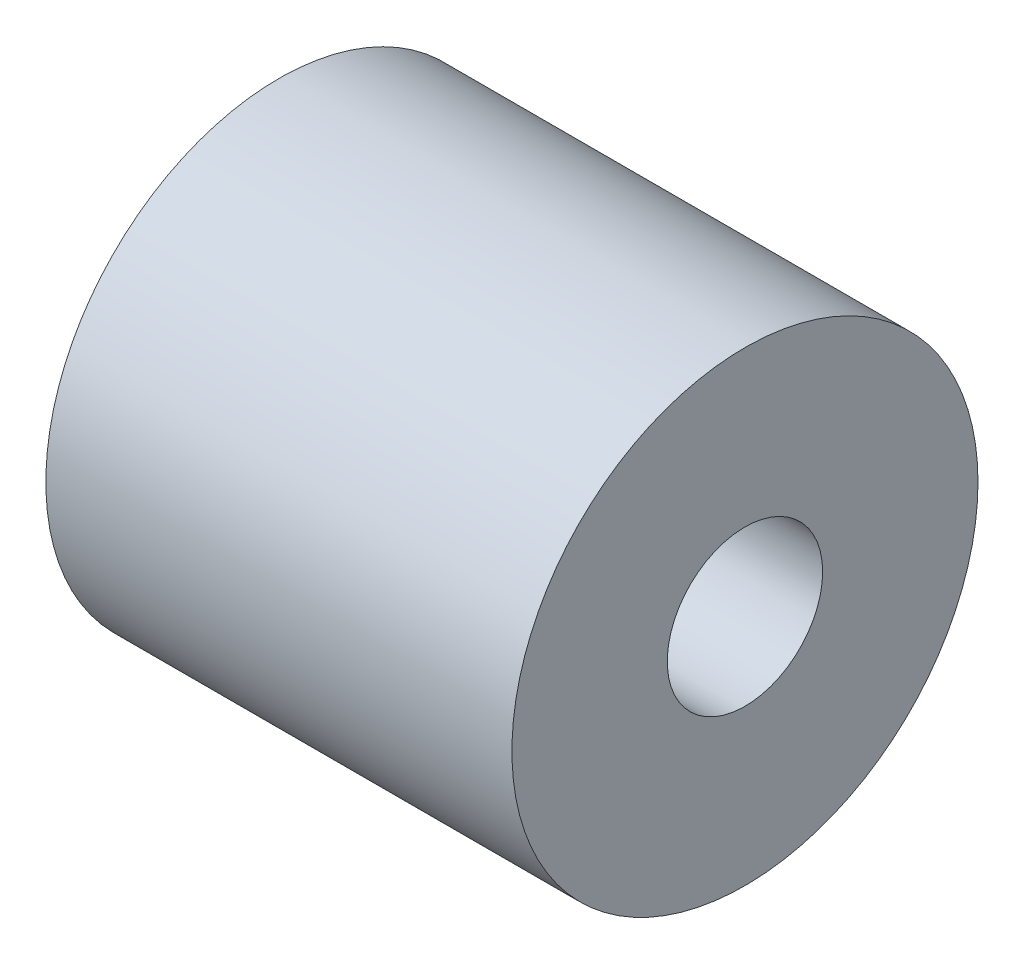
ISO-10303-21;
HEADER;
FILE_DESCRIPTION(('STEP AP214'),'2;1');
FILE_NAME('part.step','',(''),(''),'','','');
FILE_SCHEMA(('AUTOMOTIVE_DESIGN { 1 0 10303 214 1 1 1 1 }'));
ENDSEC;
DATA;
#1=APPLICATION_CONTEXT('core data for automotive mechanical design processes');
#2=APPLICATION_PROTOCOL_DEFINITION('international standard','automotive_design',2000,#1);
#3=PRODUCT_CONTEXT('',#1,'mechanical');
#4=PRODUCT('Part','Part','',(#3));
#5=PRODUCT_RELATED_PRODUCT_CATEGORY('part','',(#4));
#6=PRODUCT_DEFINITION_FORMATION('','',#4);
#7=PRODUCT_DEFINITION_CONTEXT('part definition',#1,'design');
#8=PRODUCT_DEFINITION('design','',#6,#7);
#9=PRODUCT_DEFINITION_SHAPE('','',#8);
#10=(LENGTH_UNIT() NAMED_UNIT(*) SI_UNIT(.MILLI.,.METRE.));
#11=(NAMED_UNIT(*) PLANE_ANGLE_UNIT() SI_UNIT($,.RADIAN.));
#12=(NAMED_UNIT(*) SI_UNIT($,.STERADIAN.) SOLID_ANGLE_UNIT());
#13=UNCERTAINTY_MEASURE_WITH_UNIT(LENGTH_MEASURE(1.E-05),#10,'distance_accuracy_value','');
#14=(GEOMETRIC_REPRESENTATION_CONTEXT(3) GLOBAL_UNCERTAINTY_ASSIGNED_CONTEXT((#13)) GLOBAL_UNIT_ASSIGNED_CONTEXT((#10,
#11,#12)) REPRESENTATION_CONTEXT('',''));
#15=CARTESIAN_POINT('',(0.,0.,0.));
#16=DIRECTION('',(0.,0.,1.));
#17=DIRECTION('',(1.,0.,0.));
#18=AXIS2_PLACEMENT_3D('',#15,#16,#17);
#19=CARTESIAN_POINT('',(-15.,0.,0.));
#20=DIRECTION('',(1.,0.,0.));
#21=DIRECTION('',(0.,0.,-1.));
#22=AXIS2_PLACEMENT_3D('',#19,#20,#21);
#23=CYLINDRICAL_SURFACE('',#22,3.175);
#24=CARTESIAN_POINT('',(0.,0.,0.));
#25=DIRECTION('',(1.,0.,0.));
#26=DIRECTION('',(0.,0.,-1.));
#27=AXIS2_PLACEMENT_3D('',#24,#25,#26);
#28=CIRCLE('',#27,3.175);
#29=CARTESIAN_POINT('',(0.,0.,-3.175));
#30=VERTEX_POINT('',#29);
#31=EDGE_CURVE('E10',#30,#30,#28,.T.);
#32=ORIENTED_EDGE('',*,*,#31,.T.);
#33=EDGE_LOOP('',(#32));
#34=FACE_BOUND('',#33,.T.);
#35=CARTESIAN_POINT('',(-15.,0.,0.));
#36=DIRECTION('',(1.,0.,0.));
#37=DIRECTION('',(0.,0.,-1.));
#38=AXIS2_PLACEMENT_3D('',#35,#36,#37);
#39=CIRCLE('',#38,3.175);
#40=CARTESIAN_POINT('',(-15.,0.,-3.175));
#41=VERTEX_POINT('',#40);
#42=EDGE_CURVE('E55',#41,#41,#39,.T.);
#43=ORIENTED_EDGE('',*,*,#42,.F.);
#44=EDGE_LOOP('',(#43));
#45=FACE_BOUND('',#44,.T.);
#46=ADVANCED_FACE('F33',(#34,#45),#23,.F.);
#47=CARTESIAN_POINT('',(0.,3.175,0.));
#48=DIRECTION('',(1.,0.,0.));
#49=DIRECTION('',(0.,0.,-1.));
#50=AXIS2_PLACEMENT_3D('',#47,#48,#49);
#51=PLANE('',#50);
#52=CARTESIAN_POINT('',(0.,0.,0.));
#53=DIRECTION('',(1.,0.,0.));
#54=DIRECTION('',(0.,0.,-1.));
#55=AXIS2_PLACEMENT_3D('',#52,#53,#54);
#56=CIRCLE('',#55,5.);
#57=CARTESIAN_POINT('',(0.,0.,-5.));
#58=VERTEX_POINT('',#57);
#59=EDGE_CURVE('E39',#58,#58,#56,.T.);
#60=ORIENTED_EDGE('',*,*,#59,.T.);
#61=EDGE_LOOP('',(#60));
#62=FACE_BOUND('',#61,.T.);
#63=ORIENTED_EDGE('',*,*,#31,.F.);
#64=EDGE_LOOP('',(#63));
#65=FACE_BOUND('',#64,.T.);
#66=ADVANCED_FACE('F63',(#62,#65),#51,.T.);
#67=CARTESIAN_POINT('',(-15.,0.,0.));
#68=DIRECTION('',(1.,0.,0.));
#69=DIRECTION('',(0.,0.,-1.));
#70=AXIS2_PLACEMENT_3D('',#67,#68,#69);
#71=CYLINDRICAL_SURFACE('',#70,5.);
#72=CARTESIAN_POINT('',(15.,0.,0.));
#73=DIRECTION('',(1.,0.,0.));
#74=DIRECTION('',(0.,0.,-1.));
#75=AXIS2_PLACEMENT_3D('',#72,#73,#74);
#76=CIRCLE('',#75,5.);
#77=CARTESIAN_POINT('',(15.,0.,-5.));
#78=VERTEX_POINT('',#77);
#79=EDGE_CURVE('E43',#78,#78,#76,.T.);
#80=ORIENTED_EDGE('',*,*,#79,.T.);
#81=EDGE_LOOP('',(#80));
#82=FACE_BOUND('',#81,.T.);
#83=ORIENTED_EDGE('',*,*,#59,.F.);
#84=EDGE_LOOP('',(#83));
#85=FACE_BOUND('',#84,.T.);
#86=ADVANCED_FACE('F67',(#82,#85),#71,.F.);
#87=CARTESIAN_POINT('',(15.,5.,0.));
#88=DIRECTION('',(1.,0.,0.));
#89=DIRECTION('',(0.,0.,-1.));
#90=AXIS2_PLACEMENT_3D('',#87,#88,#89);
#91=PLANE('',#90);
#92=CARTESIAN_POINT('',(15.,0.,0.));
#93=DIRECTION('',(1.,0.,0.));
#94=DIRECTION('',(0.,0.,-1.));
#95=AXIS2_PLACEMENT_3D('',#92,#93,#94);
#96=CIRCLE('',#95,15.);
#97=CARTESIAN_POINT('',(15.,0.,-15.));
#98=VERTEX_POINT('',#97);
#99=EDGE_CURVE('E47',#98,#98,#96,.T.);
#100=ORIENTED_EDGE('',*,*,#99,.T.);
#101=EDGE_LOOP('',(#100));
#102=FACE_BOUND('',#101,.T.);
#103=ORIENTED_EDGE('',*,*,#79,.F.);
#104=EDGE_LOOP('',(#103));
#105=FACE_BOUND('',#104,.T.);
#106=ADVANCED_FACE('F71',(#102,#105),#91,.T.);
#107=CARTESIAN_POINT('',(-15.,0.,0.));
#108=DIRECTION('',(1.,0.,0.));
#109=DIRECTION('',(0.,0.,-1.));
#110=AXIS2_PLACEMENT_3D('',#107,#108,#109);
#111=CYLINDRICAL_SURFACE('',#110,15.);
#112=CARTESIAN_POINT('',(-15.,0.,0.));
#113=DIRECTION('',(1.,0.,0.));
#114=DIRECTION('',(0.,0.,-1.));
#115=AXIS2_PLACEMENT_3D('',#112,#113,#114);
#116=CIRCLE('',#115,15.);
#117=CARTESIAN_POINT('',(-15.,0.,-15.));
#118=VERTEX_POINT('',#117);
#119=EDGE_CURVE('E52',#118,#118,#116,.T.);
#120=ORIENTED_EDGE('',*,*,#119,.T.);
#121=EDGE_LOOP('',(#120));
#122=FACE_BOUND('',#121,.T.);
#123=ORIENTED_EDGE('',*,*,#99,.F.);
#124=EDGE_LOOP('',(#123));
#125=FACE_BOUND('',#124,.T.);
#126=ADVANCED_FACE('F78',(#122,#125),#111,.T.);
#127=CARTESIAN_POINT('',(-15.,15.,0.));
#128=DIRECTION('',(-1.,0.,0.));
#129=DIRECTION('',(0.,0.,1.));
#130=AXIS2_PLACEMENT_3D('',#127,#128,#129);
#131=PLANE('',#130);
#132=ORIENTED_EDGE('',*,*,#42,.T.);
#133=EDGE_LOOP('',(#132));
#134=FACE_BOUND('',#133,.T.);
#135=ORIENTED_EDGE('',*,*,#119,.F.);
#136=EDGE_LOOP('',(#135));
#137=FACE_BOUND('',#136,.T.);
#138=ADVANCED_FACE('F59',(#134,#137),#131,.T.);
#139=CLOSED_SHELL('',(#46,#66,#86,#106,#126,#138));
#140=MANIFOLD_SOLID_BREP('B2',#139);
#141=ADVANCED_BREP_SHAPE_REPRESENTATION('',(#18,#140),#14);
#142=SHAPE_DEFINITION_REPRESENTATION(#9,#141);
ENDSEC;
END-ISO-10303-21;
